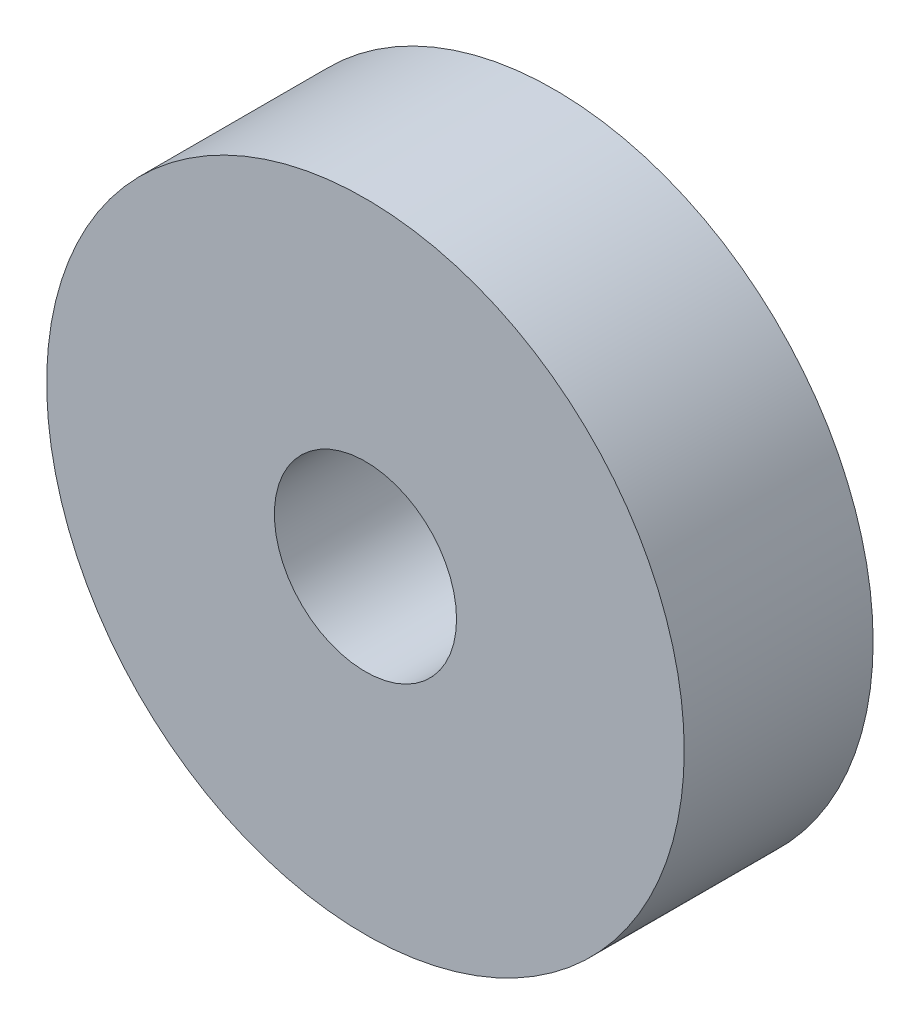
ISO-10303-21;
HEADER;
FILE_DESCRIPTION(('STEP AP214'),'2;1');
FILE_NAME('part.step','',(''),(''),'','','');
FILE_SCHEMA(('AUTOMOTIVE_DESIGN { 1 0 10303 214 1 1 1 1 }'));
ENDSEC;
DATA;
#1=APPLICATION_CONTEXT('core data for automotive mechanical design processes');
#2=APPLICATION_PROTOCOL_DEFINITION('international standard','automotive_design',2000,#1);
#3=PRODUCT_CONTEXT('',#1,'mechanical');
#4=PRODUCT('Part','Part','',(#3));
#5=PRODUCT_RELATED_PRODUCT_CATEGORY('part','',(#4));
#6=PRODUCT_DEFINITION_FORMATION('','',#4);
#7=PRODUCT_DEFINITION_CONTEXT('part definition',#1,'design');
#8=PRODUCT_DEFINITION('design','',#6,#7);
#9=PRODUCT_DEFINITION_SHAPE('','',#8);
#10=(LENGTH_UNIT() NAMED_UNIT(*) SI_UNIT(.MILLI.,.METRE.));
#11=(NAMED_UNIT(*) PLANE_ANGLE_UNIT() SI_UNIT($,.RADIAN.));
#12=(NAMED_UNIT(*) SI_UNIT($,.STERADIAN.) SOLID_ANGLE_UNIT());
#13=UNCERTAINTY_MEASURE_WITH_UNIT(LENGTH_MEASURE(1.E-05),#10,'distance_accuracy_value','');
#14=(GEOMETRIC_REPRESENTATION_CONTEXT(3) GLOBAL_UNCERTAINTY_ASSIGNED_CONTEXT((#13)) GLOBAL_UNIT_ASSIGNED_CONTEXT((#10,
#11,#12)) REPRESENTATION_CONTEXT('',''));
#15=CARTESIAN_POINT('',(0.,0.,0.));
#16=DIRECTION('',(0.,0.,1.));
#17=DIRECTION('',(1.,0.,0.));
#18=AXIS2_PLACEMENT_3D('',#15,#16,#17);
#19=CARTESIAN_POINT('',(0.,0.,20.));
#20=DIRECTION('',(0.,0.,1.));
#21=DIRECTION('',(1.,0.,0.));
#22=AXIS2_PLACEMENT_3D('',#19,#20,#21);
#23=PLANE('',#22);
#24=CARTESIAN_POINT('',(0.,0.,20.));
#25=DIRECTION('',(0.,0.,1.));
#26=DIRECTION('',(1.,0.,0.));
#27=AXIS2_PLACEMENT_3D('',#24,#25,#26);
#28=CIRCLE('',#27,33.75);
#29=CARTESIAN_POINT('',(33.75,0.,20.));
#30=VERTEX_POINT('',#29);
#31=EDGE_CURVE('E10',#30,#30,#28,.T.);
#32=ORIENTED_EDGE('',*,*,#31,.T.);
#33=EDGE_LOOP('',(#32));
#34=FACE_BOUND('',#33,.T.);
#35=CARTESIAN_POINT('',(0.,0.,20.));
#36=DIRECTION('',(0.,0.,1.));
#37=DIRECTION('',(1.,0.,0.));
#38=AXIS2_PLACEMENT_3D('',#35,#36,#37);
#39=CIRCLE('',#38,9.64285714285714);
#40=CARTESIAN_POINT('',(9.64285714285714,0.,20.));
#41=VERTEX_POINT('',#40);
#42=EDGE_CURVE('E45',#41,#41,#39,.T.);
#43=ORIENTED_EDGE('',*,*,#42,.F.);
#44=EDGE_LOOP('',(#43));
#45=FACE_BOUND('',#44,.T.);
#46=ADVANCED_FACE('F32',(#34,#45),#23,.T.);
#47=CARTESIAN_POINT('',(0.,0.,0.));
#48=DIRECTION('',(0.,0.,1.));
#49=DIRECTION('',(1.,0.,0.));
#50=AXIS2_PLACEMENT_3D('',#47,#48,#49);
#51=PLANE('',#50);
#52=CARTESIAN_POINT('',(0.,0.,0.));
#53=DIRECTION('',(0.,0.,1.));
#54=DIRECTION('',(1.,0.,0.));
#55=AXIS2_PLACEMENT_3D('',#52,#53,#54);
#56=CIRCLE('',#55,33.75);
#57=CARTESIAN_POINT('',(33.75,0.,0.));
#58=VERTEX_POINT('',#57);
#59=EDGE_CURVE('E36',#58,#58,#56,.T.);
#60=ORIENTED_EDGE('',*,*,#59,.F.);
#61=EDGE_LOOP('',(#60));
#62=FACE_BOUND('',#61,.T.);
#63=CARTESIAN_POINT('',(0.,0.,0.));
#64=DIRECTION('',(0.,0.,1.));
#65=DIRECTION('',(1.,0.,0.));
#66=AXIS2_PLACEMENT_3D('',#63,#64,#65);
#67=CIRCLE('',#66,9.64285714285714);
#68=CARTESIAN_POINT('',(9.64285714285714,0.,0.));
#69=VERTEX_POINT('',#68);
#70=EDGE_CURVE('E47',#69,#69,#67,.T.);
#71=ORIENTED_EDGE('',*,*,#70,.T.);
#72=EDGE_LOOP('',(#71));
#73=FACE_BOUND('',#72,.T.);
#74=ADVANCED_FACE('F57',(#62,#73),#51,.F.);
#75=CARTESIAN_POINT('',(0.,0.,20.));
#76=DIRECTION('',(0.,0.,-1.));
#77=DIRECTION('',(-1.,0.,0.));
#78=AXIS2_PLACEMENT_3D('',#75,#76,#77);
#79=CYLINDRICAL_SURFACE('',#78,33.75);
#80=ORIENTED_EDGE('',*,*,#31,.F.);
#81=EDGE_LOOP('',(#80));
#82=FACE_BOUND('',#81,.T.);
#83=ORIENTED_EDGE('',*,*,#59,.T.);
#84=EDGE_LOOP('',(#83));
#85=FACE_BOUND('',#84,.T.);
#86=ADVANCED_FACE('F34',(#82,#85),#79,.T.);
#87=CARTESIAN_POINT('',(0.,0.,20.));
#88=DIRECTION('',(0.,0.,-1.));
#89=DIRECTION('',(-1.,0.,0.));
#90=AXIS2_PLACEMENT_3D('',#87,#88,#89);
#91=CYLINDRICAL_SURFACE('',#90,9.64285714285714);
#92=ORIENTED_EDGE('',*,*,#42,.T.);
#93=EDGE_LOOP('',(#92));
#94=FACE_BOUND('',#93,.T.);
#95=ORIENTED_EDGE('',*,*,#70,.F.);
#96=EDGE_LOOP('',(#95));
#97=FACE_BOUND('',#96,.T.);
#98=ADVANCED_FACE('F53',(#94,#97),#91,.F.);
#99=CLOSED_SHELL('',(#46,#74,#86,#98));
#100=MANIFOLD_SOLID_BREP('B2',#99);
#101=ADVANCED_BREP_SHAPE_REPRESENTATION('',(#18,#100),#14);
#102=SHAPE_DEFINITION_REPRESENTATION(#9,#101);
ENDSEC;
END-ISO-10303-21;
